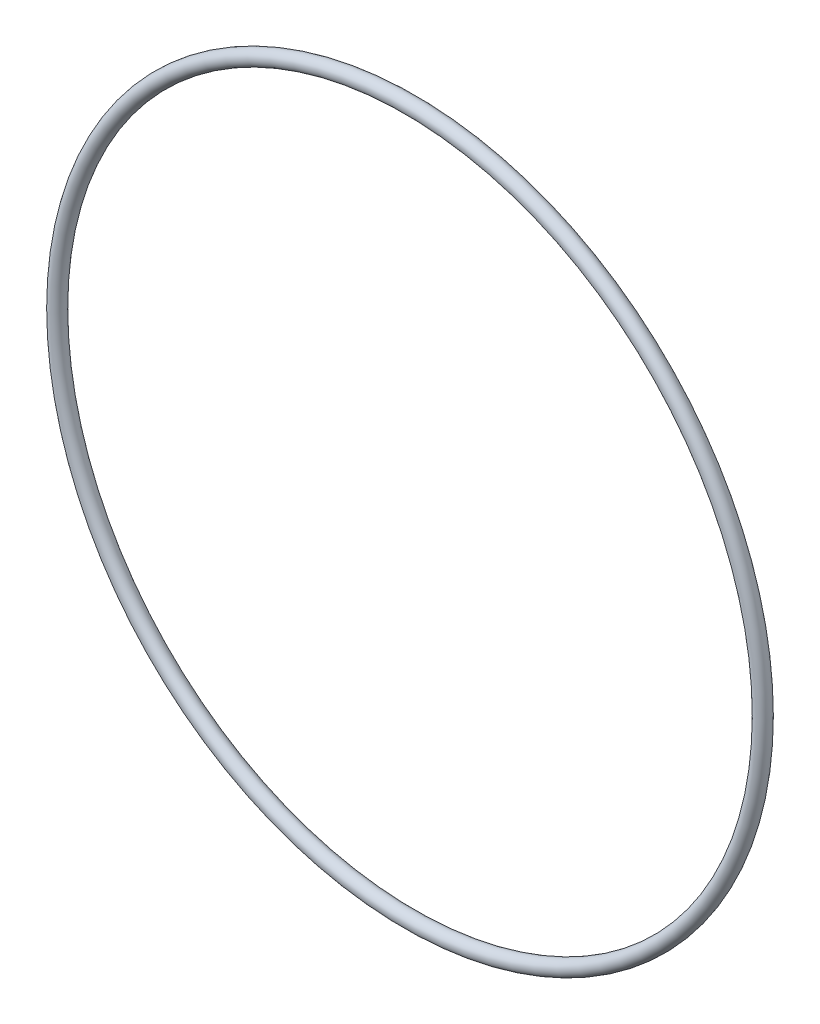
ISO-10303-21;
HEADER;
FILE_DESCRIPTION(('STEP AP214'),'2;1');
FILE_NAME('part.step','',(''),(''),'','','');
FILE_SCHEMA(('AUTOMOTIVE_DESIGN { 1 0 10303 214 1 1 1 1 }'));
ENDSEC;
DATA;
#1=APPLICATION_CONTEXT('core data for automotive mechanical design processes');
#2=APPLICATION_PROTOCOL_DEFINITION('international standard','automotive_design',2000,#1);
#3=PRODUCT_CONTEXT('',#1,'mechanical');
#4=PRODUCT('Part','Part','',(#3));
#5=PRODUCT_RELATED_PRODUCT_CATEGORY('part','',(#4));
#6=PRODUCT_DEFINITION_FORMATION('','',#4);
#7=PRODUCT_DEFINITION_CONTEXT('part definition',#1,'design');
#8=PRODUCT_DEFINITION('design','',#6,#7);
#9=PRODUCT_DEFINITION_SHAPE('','',#8);
#10=(LENGTH_UNIT() NAMED_UNIT(*) SI_UNIT(.MILLI.,.METRE.));
#11=(NAMED_UNIT(*) PLANE_ANGLE_UNIT() SI_UNIT($,.RADIAN.));
#12=(NAMED_UNIT(*) SI_UNIT($,.STERADIAN.) SOLID_ANGLE_UNIT());
#13=UNCERTAINTY_MEASURE_WITH_UNIT(LENGTH_MEASURE(1.E-05),#10,'distance_accuracy_value','');
#14=(GEOMETRIC_REPRESENTATION_CONTEXT(3) GLOBAL_UNCERTAINTY_ASSIGNED_CONTEXT((#13)) GLOBAL_UNIT_ASSIGNED_CONTEXT((#10,
#11,#12)) REPRESENTATION_CONTEXT('',''));
#15=CARTESIAN_POINT('',(0.,0.,0.));
#16=DIRECTION('',(0.,0.,1.));
#17=DIRECTION('',(1.,0.,0.));
#18=AXIS2_PLACEMENT_3D('',#15,#16,#17);
#19=CARTESIAN_POINT('',(0.,0.,0.));
#20=DIRECTION('',(0.,0.,1.));
#21=DIRECTION('',(1.,0.,0.));
#22=AXIS2_PLACEMENT_3D('',#19,#20,#21);
#23=TOROIDAL_SURFACE('',#22,42.0243,0.889000000000003);
#24=CARTESIAN_POINT('',(42.9133,0.,0.));
#25=VERTEX_POINT('',#24);
#26=VERTEX_LOOP('',#25);
#27=FACE_BOUND('',#26,.T.);
#28=ADVANCED_FACE('F35',(#27),#23,.T.);
#29=CLOSED_SHELL('',(#28));
#30=MANIFOLD_SOLID_BREP('B2',#29);
#31=ADVANCED_BREP_SHAPE_REPRESENTATION('',(#18,#30),#14);
#32=SHAPE_DEFINITION_REPRESENTATION(#9,#31);
ENDSEC;
END-ISO-10303-21;
